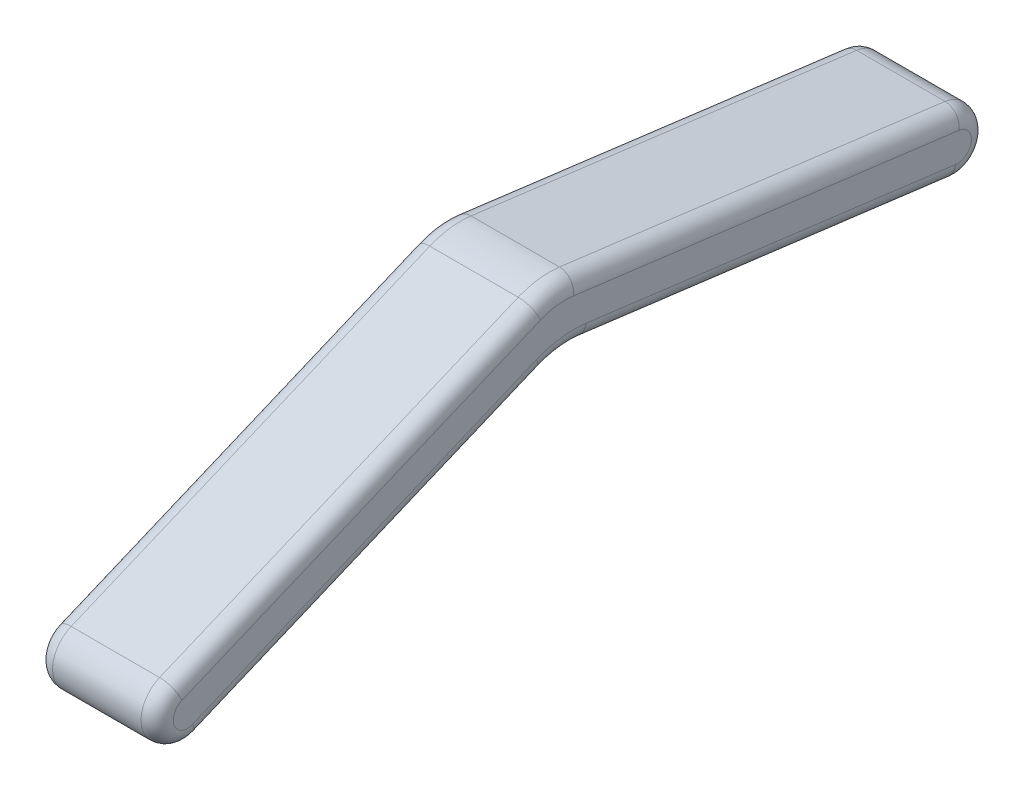
ISO-10303-21;
HEADER;
FILE_DESCRIPTION(('STEP AP214'),'2;1');
FILE_NAME('part.step','',(''),(''),'','','');
FILE_SCHEMA(('AUTOMOTIVE_DESIGN { 1 0 10303 214 1 1 1 1 }'));
ENDSEC;
DATA;
#1=APPLICATION_CONTEXT('core data for automotive mechanical design processes');
#2=APPLICATION_PROTOCOL_DEFINITION('international standard','automotive_design',2000,#1);
#3=PRODUCT_CONTEXT('',#1,'mechanical');
#4=PRODUCT('Part','Part','',(#3));
#5=PRODUCT_RELATED_PRODUCT_CATEGORY('part','',(#4));
#6=PRODUCT_DEFINITION_FORMATION('','',#4);
#7=PRODUCT_DEFINITION_CONTEXT('part definition',#1,'design');
#8=PRODUCT_DEFINITION('design','',#6,#7);
#9=PRODUCT_DEFINITION_SHAPE('','',#8);
#10=(LENGTH_UNIT() NAMED_UNIT(*) SI_UNIT(.MILLI.,.METRE.));
#11=(NAMED_UNIT(*) PLANE_ANGLE_UNIT() SI_UNIT($,.RADIAN.));
#12=(NAMED_UNIT(*) SI_UNIT($,.STERADIAN.) SOLID_ANGLE_UNIT());
#13=UNCERTAINTY_MEASURE_WITH_UNIT(LENGTH_MEASURE(1.E-05),#10,'distance_accuracy_value','');
#14=(GEOMETRIC_REPRESENTATION_CONTEXT(3) GLOBAL_UNCERTAINTY_ASSIGNED_CONTEXT((#13)) GLOBAL_UNIT_ASSIGNED_CONTEXT((#10,
#11,#12)) REPRESENTATION_CONTEXT('',''));
#15=CARTESIAN_POINT('',(0.,0.,0.));
#16=DIRECTION('',(0.,0.,1.));
#17=DIRECTION('',(1.,0.,0.));
#18=AXIS2_PLACEMENT_3D('',#15,#16,#17);
#19=CARTESIAN_POINT('',(7.5,5.18774565598026,-48.0342974570473));
#20=DIRECTION('',(-1.,0.,0.));
#21=DIRECTION('',(0.,0.,-1.));
#22=AXIS2_PLACEMENT_3D('',#19,#20,#21);
#23=CYLINDRICAL_SURFACE('',#22,9.99999999999999);
#24=DIRECTION('',(-1.,0.,0.));
#25=VECTOR('',#24,1.);
#26=CARTESIAN_POINT('',(7.5,14.4131959272416,-44.175402888329));
#27=LINE('',#26,#25);
#28=CARTESIAN_POINT('',(5.5,14.4131959272416,-44.175402888329));
#29=VERTEX_POINT('',#28);
#30=CARTESIAN_POINT('',(-5.5,14.4131959272416,-44.175402888329));
#31=VERTEX_POINT('',#30);
#32=EDGE_CURVE('E177',#29,#31,#27,.T.);
#33=ORIENTED_EDGE('',*,*,#32,.T.);
#34=CARTESIAN_POINT('',(-5.5,5.18774565598026,-48.0342974570473));
#35=DIRECTION('',(-1.,0.,0.));
#36=DIRECTION('',(0.,0.,1.));
#37=AXIS2_PLACEMENT_3D('',#34,#35,#36);
#38=CIRCLE('',#37,9.99999999999999);
#39=CARTESIAN_POINT('',(-5.5,15.1066672366018,-49.3051218656422));
#40=VERTEX_POINT('',#39);
#41=EDGE_CURVE('E236',#40,#31,#38,.F.);
#42=ORIENTED_EDGE('',*,*,#41,.F.);
#43=DIRECTION('',(-1.,0.,0.));
#44=VECTOR('',#43,1.);
#45=CARTESIAN_POINT('',(7.5,15.1066672366018,-49.3051218656422));
#46=LINE('',#45,#44);
#47=CARTESIAN_POINT('',(5.5,15.1066672366018,-49.3051218656422));
#48=VERTEX_POINT('',#47);
#49=EDGE_CURVE('E271',#48,#40,#46,.T.);
#50=ORIENTED_EDGE('',*,*,#49,.F.);
#51=CARTESIAN_POINT('',(5.5,5.18774565598026,-48.0342974570473));
#52=DIRECTION('',(-1.,0.,0.));
#53=DIRECTION('',(0.,0.,1.));
#54=AXIS2_PLACEMENT_3D('',#51,#52,#53);
#55=CIRCLE('',#54,9.99999999999999);
#56=EDGE_CURVE('E157',#29,#48,#55,.T.);
#57=ORIENTED_EDGE('',*,*,#56,.F.);
#58=EDGE_LOOP('',(#33,#42,#50,#57));
#59=FACE_BOUND('',#58,.T.);
#60=ADVANCED_FACE('F34',(#59),#23,.F.);
#61=CARTESIAN_POINT('',(7.5,-3.45954385172302,-1.44708546326935));
#62=DIRECTION('',(0.,0.922545027126137,0.385889456871828));
#63=DIRECTION('',(0.,0.385889456871828,-0.922545027126138));
#64=AXIS2_PLACEMENT_3D('',#61,#62,#63);
#65=PLANE('',#64);
#66=DIRECTION('',(-1.,0.,0.));
#67=VECTOR('',#66,1.);
#68=CARTESIAN_POINT('',(7.5,-3.45954385172302,-1.44708546326935));
#69=LINE('',#68,#67);
#70=CARTESIAN_POINT('',(5.5,-3.45954385172302,-1.44708546326935));
#71=VERTEX_POINT('',#70);
#72=CARTESIAN_POINT('',(-5.5,-3.45954385172302,-1.44708546326935));
#73=VERTEX_POINT('',#72);
#74=EDGE_CURVE('E182',#71,#73,#69,.T.);
#75=ORIENTED_EDGE('',*,*,#74,.T.);
#76=DIRECTION('',(0.,-0.385889456871828,0.922545027126138));
#77=VECTOR('',#76,1.);
#78=CARTESIAN_POINT('',(-5.5,-3.45954385172302,-1.44708546326935));
#79=LINE('',#78,#77);
#80=EDGE_CURVE('E231',#31,#73,#79,.T.);
#81=ORIENTED_EDGE('',*,*,#80,.F.);
#82=ORIENTED_EDGE('',*,*,#32,.F.);
#83=DIRECTION('',(0.,-0.385889456871828,0.922545027126138));
#84=VECTOR('',#83,1.);
#85=CARTESIAN_POINT('',(5.5,14.4131959272416,-44.175402888329));
#86=LINE('',#85,#84);
#87=EDGE_CURVE('E233',#71,#29,#86,.F.);
#88=ORIENTED_EDGE('',*,*,#87,.F.);
#89=EDGE_LOOP('',(#75,#81,#82,#88));
#90=FACE_BOUND('',#89,.T.);
#91=ADVANCED_FACE('F324',(#90),#65,.F.);
#92=CARTESIAN_POINT('',(7.5,0.,0.));
#93=DIRECTION('',(-1.,0.,0.));
#94=DIRECTION('',(0.,0.,-1.));
#95=AXIS2_PLACEMENT_3D('',#92,#93,#94);
#96=CYLINDRICAL_SURFACE('',#95,3.75);
#97=DIRECTION('',(-1.,0.,0.));
#98=VECTOR('',#97,1.);
#99=CARTESIAN_POINT('',(7.5,3.45954385172302,1.44708546326936));
#100=LINE('',#99,#98);
#101=CARTESIAN_POINT('',(5.5,3.45954385172302,1.44708546326936));
#102=VERTEX_POINT('',#101);
#103=CARTESIAN_POINT('',(-5.5,3.45954385172302,1.44708546326936));
#104=VERTEX_POINT('',#103);
#105=EDGE_CURVE('E312',#102,#104,#100,.T.);
#106=ORIENTED_EDGE('',*,*,#105,.T.);
#107=CARTESIAN_POINT('',(-5.5,0.,0.));
#108=DIRECTION('',(-1.,0.,0.));
#109=DIRECTION('',(0.,0.,1.));
#110=AXIS2_PLACEMENT_3D('',#107,#108,#109);
#111=CIRCLE('',#110,3.75);
#112=EDGE_CURVE('E226',#73,#104,#111,.T.);
#113=ORIENTED_EDGE('',*,*,#112,.F.);
#114=ORIENTED_EDGE('',*,*,#74,.F.);
#115=CARTESIAN_POINT('',(5.5,0.,0.));
#116=DIRECTION('',(-1.,0.,0.));
#117=DIRECTION('',(0.,0.,1.));
#118=AXIS2_PLACEMENT_3D('',#115,#116,#117);
#119=CIRCLE('',#118,3.75);
#120=EDGE_CURVE('E228',#102,#71,#119,.F.);
#121=ORIENTED_EDGE('',*,*,#120,.F.);
#122=EDGE_LOOP('',(#106,#113,#114,#121));
#123=FACE_BOUND('',#122,.T.);
#124=ADVANCED_FACE('F329',(#123),#96,.T.);
#125=CARTESIAN_POINT('',(7.5,3.45954385172302,1.44708546326935));
#126=DIRECTION('',(0.,-0.922545027126137,-0.385889456871828));
#127=DIRECTION('',(0.,-0.385889456871828,0.922545027126138));
#128=AXIS2_PLACEMENT_3D('',#125,#126,#127);
#129=PLANE('',#128);
#130=DIRECTION('',(-1.,0.,0.));
#131=VECTOR('',#130,1.);
#132=CARTESIAN_POINT('',(7.5,22.1077743932113,-43.1351959242888));
#133=LINE('',#132,#131);
#134=CARTESIAN_POINT('',(5.5,22.1077743932113,-43.1351959242888));
#135=VERTEX_POINT('',#134);
#136=CARTESIAN_POINT('',(-5.5,22.1077743932113,-43.1351959242888));
#137=VERTEX_POINT('',#136);
#138=EDGE_CURVE('E308',#135,#137,#133,.T.);
#139=ORIENTED_EDGE('',*,*,#138,.T.);
#140=DIRECTION('',(0.,0.385889456871828,-0.922545027126138));
#141=VECTOR('',#140,1.);
#142=CARTESIAN_POINT('',(-5.5,3.45954385172302,1.44708546326935));
#143=LINE('',#142,#141);
#144=EDGE_CURVE('E220',#104,#137,#143,.T.);
#145=ORIENTED_EDGE('',*,*,#144,.F.);
#146=ORIENTED_EDGE('',*,*,#105,.F.);
#147=DIRECTION('',(0.,0.385889456871828,-0.922545027126138));
#148=VECTOR('',#147,1.);
#149=CARTESIAN_POINT('',(5.5,3.45954385172301,1.44708546326937));
#150=LINE('',#149,#148);
#151=EDGE_CURVE('E223',#135,#102,#150,.F.);
#152=ORIENTED_EDGE('',*,*,#151,.F.);
#153=EDGE_LOOP('',(#139,#145,#146,#152));
#154=FACE_BOUND('',#153,.T.);
#155=ADVANCED_FACE('F404',(#154),#129,.F.);
#156=CARTESIAN_POINT('',(7.5,12.88232412195,-46.9940904930071));
#157=DIRECTION('',(-1.,0.,0.));
#158=DIRECTION('',(0.,0.,-1.));
#159=AXIS2_PLACEMENT_3D('',#156,#157,#158);
#160=CYLINDRICAL_SURFACE('',#159,10.);
#161=DIRECTION('',(-1.,0.,0.));
#162=VECTOR('',#161,1.);
#163=CARTESIAN_POINT('',(7.5,22.8012457025715,-48.264914901602));
#164=LINE('',#163,#162);
#165=CARTESIAN_POINT('',(5.5,22.8012457025715,-48.264914901602));
#166=VERTEX_POINT('',#165);
#167=CARTESIAN_POINT('',(-5.5,22.8012457025715,-48.264914901602));
#168=VERTEX_POINT('',#167);
#169=EDGE_CURVE('E304',#166,#168,#164,.T.);
#170=ORIENTED_EDGE('',*,*,#169,.T.);
#171=CARTESIAN_POINT('',(-5.5,12.88232412195,-46.9940904930071));
#172=DIRECTION('',(-1.,0.,0.));
#173=DIRECTION('',(0.,0.,1.));
#174=AXIS2_PLACEMENT_3D('',#171,#172,#173);
#175=CIRCLE('',#174,10.);
#176=EDGE_CURVE('E214',#137,#168,#175,.T.);
#177=ORIENTED_EDGE('',*,*,#176,.F.);
#178=ORIENTED_EDGE('',*,*,#138,.F.);
#179=CARTESIAN_POINT('',(5.5,12.88232412195,-46.9940904930071));
#180=DIRECTION('',(-1.,0.,0.));
#181=DIRECTION('',(0.,0.,1.));
#182=AXIS2_PLACEMENT_3D('',#179,#180,#181);
#183=CIRCLE('',#182,10.);
#184=EDGE_CURVE('E217',#166,#135,#183,.F.);
#185=ORIENTED_EDGE('',*,*,#184,.F.);
#186=EDGE_LOOP('',(#170,#177,#178,#185));
#187=FACE_BOUND('',#186,.T.);
#188=ADVANCED_FACE('F305',(#187),#160,.T.);
#189=CARTESIAN_POINT('',(7.5,22.8012457025715,-48.264914901602));
#190=DIRECTION('',(0.,-0.991892158062153,0.127082440859488));
#191=DIRECTION('',(0.,0.127082440859488,0.991892158062153));
#192=AXIS2_PLACEMENT_3D('',#189,#190,#191);
#193=PLANE('',#192);
#194=DIRECTION('',(-1.,0.,0.));
#195=VECTOR('',#194,1.);
#196=CARTESIAN_POINT('',(7.5,16.6599463933501,-96.1984184126376));
#197=LINE('',#196,#195);
#198=CARTESIAN_POINT('',(5.5,16.6599463933501,-96.1984184126376));
#199=VERTEX_POINT('',#198);
#200=CARTESIAN_POINT('',(-5.5,16.6599463933501,-96.1984184126376));
#201=VERTEX_POINT('',#200);
#202=EDGE_CURVE('E309',#199,#201,#197,.T.);
#203=ORIENTED_EDGE('',*,*,#202,.T.);
#204=DIRECTION('',(0.,-0.127082440859488,-0.991892158062153));
#205=VECTOR('',#204,1.);
#206=CARTESIAN_POINT('',(-5.5,22.8012457025715,-48.264914901602));
#207=LINE('',#206,#205);
#208=EDGE_CURVE('E208',#168,#201,#207,.T.);
#209=ORIENTED_EDGE('',*,*,#208,.F.);
#210=ORIENTED_EDGE('',*,*,#169,.F.);
#211=DIRECTION('',(0.,-0.127082440859488,-0.991892158062153));
#212=VECTOR('',#211,1.);
#213=CARTESIAN_POINT('',(5.5,22.8012457025715,-48.264914901602));
#214=LINE('',#213,#212);
#215=EDGE_CURVE('E211',#199,#166,#214,.F.);
#216=ORIENTED_EDGE('',*,*,#215,.F.);
#217=EDGE_LOOP('',(#203,#209,#210,#216));
#218=FACE_BOUND('',#217,.T.);
#219=ADVANCED_FACE('F484',(#218),#193,.F.);
#220=CARTESIAN_POINT('',(7.5,12.940350800617,-95.7218592594145));
#221=DIRECTION('',(-1.,0.,0.));
#222=DIRECTION('',(0.,0.,-1.));
#223=AXIS2_PLACEMENT_3D('',#220,#221,#222);
#224=CYLINDRICAL_SURFACE('',#223,3.75);
#225=DIRECTION('',(-1.,0.,0.));
#226=VECTOR('',#225,1.);
#227=CARTESIAN_POINT('',(7.5,9.22075520788394,-95.2453001061914));
#228=LINE('',#227,#226);
#229=CARTESIAN_POINT('',(5.5,9.22075520788394,-95.2453001061914));
#230=VERTEX_POINT('',#229);
#231=CARTESIAN_POINT('',(-5.5,9.22075520788394,-95.2453001061914));
#232=VERTEX_POINT('',#231);
#233=EDGE_CURVE('E314',#230,#232,#228,.T.);
#234=ORIENTED_EDGE('',*,*,#233,.T.);
#235=CARTESIAN_POINT('',(-5.5,12.940350800617,-95.7218592594145));
#236=DIRECTION('',(-1.,0.,0.));
#237=DIRECTION('',(0.,0.,1.));
#238=AXIS2_PLACEMENT_3D('',#235,#236,#237);
#239=CIRCLE('',#238,3.75);
#240=EDGE_CURVE('E202',#201,#232,#239,.T.);
#241=ORIENTED_EDGE('',*,*,#240,.F.);
#242=ORIENTED_EDGE('',*,*,#202,.F.);
#243=CARTESIAN_POINT('',(5.5,12.940350800617,-95.7218592594145));
#244=DIRECTION('',(-1.,0.,0.));
#245=DIRECTION('',(0.,0.,1.));
#246=AXIS2_PLACEMENT_3D('',#243,#244,#245);
#247=CIRCLE('',#246,3.75);
#248=EDGE_CURVE('E205',#230,#199,#247,.F.);
#249=ORIENTED_EDGE('',*,*,#248,.F.);
#250=EDGE_LOOP('',(#234,#241,#242,#249));
#251=FACE_BOUND('',#250,.T.);
#252=ADVANCED_FACE('F345',(#251),#224,.T.);
#253=CARTESIAN_POINT('',(7.5,15.1066672366018,-49.3051218656422));
#254=DIRECTION('',(0.,0.991892158062153,-0.127082440859488));
#255=DIRECTION('',(0.,-0.127082440859488,-0.991892158062153));
#256=AXIS2_PLACEMENT_3D('',#253,#254,#255);
#257=PLANE('',#256);
#258=ORIENTED_EDGE('',*,*,#49,.T.);
#259=DIRECTION('',(0.,0.127082440859488,0.991892158062153));
#260=VECTOR('',#259,1.);
#261=CARTESIAN_POINT('',(-5.5,15.1066672366018,-49.3051218656422));
#262=LINE('',#261,#260);
#263=EDGE_CURVE('E170',#232,#40,#262,.T.);
#264=ORIENTED_EDGE('',*,*,#263,.F.);
#265=ORIENTED_EDGE('',*,*,#233,.F.);
#266=DIRECTION('',(0.,0.127082440859488,0.991892158062153));
#267=VECTOR('',#266,1.);
#268=CARTESIAN_POINT('',(5.5,9.22075520788394,-95.2453001061915));
#269=LINE('',#268,#267);
#270=EDGE_CURVE('E200',#48,#230,#269,.F.);
#271=ORIENTED_EDGE('',*,*,#270,.F.);
#272=EDGE_LOOP('',(#258,#264,#265,#271));
#273=FACE_BOUND('',#272,.T.);
#274=ADVANCED_FACE('F347',(#273),#257,.F.);
#275=CARTESIAN_POINT('',(7.5,5.18774565598026,-48.0342974570473));
#276=DIRECTION('',(1.,0.,0.));
#277=DIRECTION('',(0.,0.,1.));
#278=AXIS2_PLACEMENT_3D('',#275,#276,#277);
#279=PLANE('',#278);
#280=CARTESIAN_POINT('',(7.5,12.940350800617,-95.7218592594145));
#281=DIRECTION('',(-1.,0.,0.));
#282=DIRECTION('',(0.,0.,1.));
#283=AXIS2_PLACEMENT_3D('',#280,#281,#282);
#284=CIRCLE('',#283,1.75);
#285=CARTESIAN_POINT('',(7.5,14.6761620772258,-95.9442535309186));
#286=VERTEX_POINT('',#285);
#287=CARTESIAN_POINT('',(7.5,11.2045395240082,-95.4994649879104));
#288=VERTEX_POINT('',#287);
#289=EDGE_CURVE('E171',#286,#288,#284,.T.);
#290=ORIENTED_EDGE('',*,*,#289,.F.);
#291=DIRECTION('',(0.,-0.127082440859488,-0.991892158062153));
#292=VECTOR('',#291,1.);
#293=CARTESIAN_POINT('',(7.5,14.6761620772258,-95.9442535309186));
#294=LINE('',#293,#292);
#295=CARTESIAN_POINT('',(7.5,20.8174613864472,-48.010750019883));
#296=VERTEX_POINT('',#295);
#297=EDGE_CURVE('E194',#296,#286,#294,.T.);
#298=ORIENTED_EDGE('',*,*,#297,.F.);
#299=CARTESIAN_POINT('',(7.5,12.88232412195,-46.9940904930071));
#300=DIRECTION('',(-1.,0.,0.));
#301=DIRECTION('',(0.,0.,1.));
#302=AXIS2_PLACEMENT_3D('',#299,#300,#301);
#303=CIRCLE('',#302,8.);
#304=CARTESIAN_POINT('',(7.5,20.2626843389591,-43.9069748380324));
#305=VERTEX_POINT('',#304);
#306=EDGE_CURVE('E191',#305,#296,#303,.T.);
#307=ORIENTED_EDGE('',*,*,#306,.F.);
#308=DIRECTION('',(0.,0.385889456871828,-0.922545027126138));
#309=VECTOR('',#308,1.);
#310=CARTESIAN_POINT('',(7.5,20.2626843389591,-43.9069748380324));
#311=LINE('',#310,#309);
#312=CARTESIAN_POINT('',(7.5,1.61445379747074,0.675306549525699));
#313=VERTEX_POINT('',#312);
#314=EDGE_CURVE('E188',#313,#305,#311,.T.);
#315=ORIENTED_EDGE('',*,*,#314,.F.);
#316=CARTESIAN_POINT('',(7.5,0.,0.));
#317=DIRECTION('',(-1.,0.,0.));
#318=DIRECTION('',(0.,0.,1.));
#319=AXIS2_PLACEMENT_3D('',#316,#317,#318);
#320=CIRCLE('',#319,1.75);
#321=CARTESIAN_POINT('',(7.5,-1.61445379747074,-0.675306549525699));
#322=VERTEX_POINT('',#321);
#323=EDGE_CURVE('E179',#322,#313,#320,.T.);
#324=ORIENTED_EDGE('',*,*,#323,.F.);
#325=DIRECTION('',(0.,-0.385889456871828,0.922545027126138));
#326=VECTOR('',#325,1.);
#327=CARTESIAN_POINT('',(7.5,-1.61445379747075,-0.675306549525682));
#328=LINE('',#327,#326);
#329=CARTESIAN_POINT('',(7.5,16.2582859814939,-43.4036239745853));
#330=VERTEX_POINT('',#329);
#331=EDGE_CURVE('E176',#330,#322,#328,.T.);
#332=ORIENTED_EDGE('',*,*,#331,.F.);
#333=CARTESIAN_POINT('',(7.5,5.18774565598026,-48.0342974570473));
#334=DIRECTION('',(-1.,0.,0.));
#335=DIRECTION('',(0.,0.,1.));
#336=AXIS2_PLACEMENT_3D('',#333,#334,#335);
#337=CIRCLE('',#336,12.);
#338=CARTESIAN_POINT('',(7.5,17.0904515527261,-49.5592867473612));
#339=VERTEX_POINT('',#338);
#340=EDGE_CURVE('E154',#339,#330,#337,.F.);
#341=ORIENTED_EDGE('',*,*,#340,.F.);
#342=DIRECTION('',(0.,0.127082440859488,0.991892158062153));
#343=VECTOR('',#342,1.);
#344=CARTESIAN_POINT('',(7.5,17.0904515527261,-49.5592867473612));
#345=LINE('',#344,#343);
#346=EDGE_CURVE('E165',#288,#339,#345,.T.);
#347=ORIENTED_EDGE('',*,*,#346,.F.);
#348=EDGE_LOOP('',(#290,#298,#307,#315,#324,#332,#341,#347));
#349=FACE_BOUND('',#348,.T.);
#350=ADVANCED_FACE('F173',(#349),#279,.T.);
#351=CARTESIAN_POINT('',(-7.5,5.18774565598026,-48.0342974570473));
#352=DIRECTION('',(1.,0.,0.));
#353=DIRECTION('',(0.,0.,1.));
#354=AXIS2_PLACEMENT_3D('',#351,#352,#353);
#355=PLANE('',#354);
#356=CARTESIAN_POINT('',(-7.5,0.,0.));
#357=DIRECTION('',(-1.,0.,0.));
#358=DIRECTION('',(0.,0.,1.));
#359=AXIS2_PLACEMENT_3D('',#356,#357,#358);
#360=CIRCLE('',#359,1.75);
#361=CARTESIAN_POINT('',(-7.5,1.61445379747074,0.675306549525699));
#362=VERTEX_POINT('',#361);
#363=CARTESIAN_POINT('',(-7.5,-1.61445379747074,-0.675306549525699));
#364=VERTEX_POINT('',#363);
#365=EDGE_CURVE('E43',#362,#364,#360,.F.);
#366=ORIENTED_EDGE('',*,*,#365,.F.);
#367=DIRECTION('',(0.,0.385889456871828,-0.922545027126138));
#368=VECTOR('',#367,1.);
#369=CARTESIAN_POINT('',(-7.5,19.4871935764354,-42.053010875534));
#370=LINE('',#369,#368);
#371=CARTESIAN_POINT('',(-7.5,20.2626843389591,-43.9069748380324));
#372=VERTEX_POINT('',#371);
#373=EDGE_CURVE('E255',#372,#362,#370,.F.);
#374=ORIENTED_EDGE('',*,*,#373,.F.);
#375=CARTESIAN_POINT('',(-7.5,12.88232412195,-46.9940904930071));
#376=DIRECTION('',(-1.,0.,0.));
#377=DIRECTION('',(0.,0.,1.));
#378=AXIS2_PLACEMENT_3D('',#375,#376,#377);
#379=CIRCLE('',#378,8.);
#380=CARTESIAN_POINT('',(-7.5,20.8174613864472,-48.010750019883));
#381=VERTEX_POINT('',#380);
#382=EDGE_CURVE('E252',#381,#372,#379,.F.);
#383=ORIENTED_EDGE('',*,*,#382,.F.);
#384=DIRECTION('',(0.,-0.127082440859488,-0.991892158062153));
#385=VECTOR('',#384,1.);
#386=CARTESIAN_POINT('',(-7.5,20.5620741059436,-50.0040752903694));
#387=LINE('',#386,#385);
#388=CARTESIAN_POINT('',(-7.5,14.6761620772258,-95.9442535309186));
#389=VERTEX_POINT('',#388);
#390=EDGE_CURVE('E249',#389,#381,#387,.F.);
#391=ORIENTED_EDGE('',*,*,#390,.F.);
#392=CARTESIAN_POINT('',(-7.5,12.940350800617,-95.7218592594145));
#393=DIRECTION('',(-1.,0.,0.));
#394=DIRECTION('',(0.,0.,1.));
#395=AXIS2_PLACEMENT_3D('',#392,#393,#394);
#396=CIRCLE('',#395,1.75);
#397=CARTESIAN_POINT('',(-7.5,11.2045395240082,-95.4994649879104));
#398=VERTEX_POINT('',#397);
#399=EDGE_CURVE('E246',#398,#389,#396,.F.);
#400=ORIENTED_EDGE('',*,*,#399,.F.);
#401=DIRECTION('',(0.,0.127082440859488,0.991892158062153));
#402=VECTOR('',#401,1.);
#403=CARTESIAN_POINT('',(-7.5,17.0904515527261,-49.5592867473612));
#404=LINE('',#403,#402);
#405=CARTESIAN_POINT('',(-7.5,17.0904515527261,-49.5592867473612));
#406=VERTEX_POINT('',#405);
#407=EDGE_CURVE('E243',#406,#398,#404,.F.);
#408=ORIENTED_EDGE('',*,*,#407,.F.);
#409=CARTESIAN_POINT('',(-7.5,5.18774565598026,-48.0342974570473));
#410=DIRECTION('',(-1.,0.,0.));
#411=DIRECTION('',(0.,0.,1.));
#412=AXIS2_PLACEMENT_3D('',#409,#410,#411);
#413=CIRCLE('',#412,12.);
#414=CARTESIAN_POINT('',(-7.5,16.2582859814939,-43.4036239745853));
#415=VERTEX_POINT('',#414);
#416=EDGE_CURVE('E240',#415,#406,#413,.T.);
#417=ORIENTED_EDGE('',*,*,#416,.F.);
#418=DIRECTION('',(0.,-0.385889456871828,0.922545027126138));
#419=VECTOR('',#418,1.);
#420=CARTESIAN_POINT('',(-7.5,16.2582859814939,-43.4036239745854));
#421=LINE('',#420,#419);
#422=EDGE_CURVE('E11',#364,#415,#421,.F.);
#423=ORIENTED_EDGE('',*,*,#422,.F.);
#424=EDGE_LOOP('',(#366,#374,#383,#391,#400,#408,#417,#423));
#425=FACE_BOUND('',#424,.T.);
#426=ADVANCED_FACE('F294',(#425),#355,.F.);
#427=CARTESIAN_POINT('',(5.5,19.4871935764354,-42.053010875534));
#428=DIRECTION('',(0.,-0.385889456871828,0.922545027126138));
#429=DIRECTION('',(0.,0.922545027126137,0.385889456871828));
#430=AXIS2_PLACEMENT_3D('',#427,#428,#429);
#431=CYLINDRICAL_SURFACE('',#430,2.);
#432=CARTESIAN_POINT('',(5.5,1.61445379747074,0.675306549525699));
#433=DIRECTION('',(0.,0.385889456871828,-0.922545027126137));
#434=DIRECTION('',(0.,0.922545027126138,0.385889456871828));
#435=AXIS2_PLACEMENT_3D('',#432,#433,#434);
#436=CIRCLE('',#435,2.);
#437=EDGE_CURVE('E267',#102,#313,#436,.T.);
#438=ORIENTED_EDGE('',*,*,#437,.T.);
#439=ORIENTED_EDGE('',*,*,#314,.T.);
#440=CARTESIAN_POINT('',(5.5,20.2626843389591,-43.9069748380324));
#441=DIRECTION('',(0.,-0.385889456871831,0.922545027126136));
#442=DIRECTION('',(0.,-0.922545027126136,-0.385889456871831));
#443=AXIS2_PLACEMENT_3D('',#440,#441,#442);
#444=CIRCLE('',#443,2.);
#445=EDGE_CURVE('E269',#305,#135,#444,.T.);
#446=ORIENTED_EDGE('',*,*,#445,.T.);
#447=ORIENTED_EDGE('',*,*,#151,.T.);
#448=EDGE_LOOP('',(#438,#439,#446,#447));
#449=FACE_BOUND('',#448,.T.);
#450=ADVANCED_FACE('F391',(#449),#431,.T.);
#451=CARTESIAN_POINT('',(5.5,12.88232412195,-46.9940904930071));
#452=DIRECTION('',(1.,0.,0.));
#453=DIRECTION('',(0.,0.,1.));
#454=AXIS2_PLACEMENT_3D('',#451,#452,#453);
#455=TOROIDAL_SURFACE('',#454,8.,2.);
#456=ORIENTED_EDGE('',*,*,#445,.F.);
#457=ORIENTED_EDGE('',*,*,#306,.T.);
#458=CARTESIAN_POINT('',(5.5,20.8174613864472,-48.010750019883));
#459=DIRECTION('',(0.,0.127082440859488,0.991892158062153));
#460=DIRECTION('',(0.,-0.991892158062153,0.127082440859488));
#461=AXIS2_PLACEMENT_3D('',#458,#459,#460);
#462=CIRCLE('',#461,2.);
#463=EDGE_CURVE('E265',#296,#166,#462,.T.);
#464=ORIENTED_EDGE('',*,*,#463,.T.);
#465=ORIENTED_EDGE('',*,*,#184,.T.);
#466=EDGE_LOOP('',(#456,#457,#464,#465));
#467=FACE_BOUND('',#466,.T.);
#468=ADVANCED_FACE('F387',(#467),#455,.T.);
#469=CARTESIAN_POINT('',(5.5,0.,0.));
#470=DIRECTION('',(1.,0.,0.));
#471=DIRECTION('',(0.,0.,1.));
#472=AXIS2_PLACEMENT_3D('',#469,#470,#471);
#473=DEGENERATE_TOROIDAL_SURFACE('',#472,1.75,2.,.T.);
#474=ORIENTED_EDGE('',*,*,#437,.F.);
#475=ORIENTED_EDGE('',*,*,#120,.T.);
#476=CARTESIAN_POINT('',(5.5,-1.61445379747074,-0.675306549525699));
#477=DIRECTION('',(0.,-0.385889456871828,0.922545027126137));
#478=DIRECTION('',(0.,-0.922545027126138,-0.385889456871828));
#479=AXIS2_PLACEMENT_3D('',#476,#477,#478);
#480=CIRCLE('',#479,2.);
#481=EDGE_CURVE('E263',#71,#322,#480,.T.);
#482=ORIENTED_EDGE('',*,*,#481,.T.);
#483=ORIENTED_EDGE('',*,*,#323,.T.);
#484=EDGE_LOOP('',(#474,#475,#482,#483));
#485=FACE_BOUND('',#484,.T.);
#486=ADVANCED_FACE('F383',(#485),#473,.T.);
#487=CARTESIAN_POINT('',(5.5,20.5620741059436,-50.0040752903694));
#488=DIRECTION('',(0.,0.127082440859488,0.991892158062153));
#489=DIRECTION('',(0.,0.991892158062153,-0.127082440859488));
#490=AXIS2_PLACEMENT_3D('',#487,#488,#489);
#491=CYLINDRICAL_SURFACE('',#490,2.);
#492=ORIENTED_EDGE('',*,*,#463,.F.);
#493=ORIENTED_EDGE('',*,*,#297,.T.);
#494=CARTESIAN_POINT('',(5.5,14.6761620772258,-95.9442535309186));
#495=DIRECTION('',(0.,0.127082440859488,0.991892158062153));
#496=DIRECTION('',(0.,-0.991892158062153,0.127082440859488));
#497=AXIS2_PLACEMENT_3D('',#494,#495,#496);
#498=CIRCLE('',#497,2.);
#499=EDGE_CURVE('E261',#286,#199,#498,.T.);
#500=ORIENTED_EDGE('',*,*,#499,.T.);
#501=ORIENTED_EDGE('',*,*,#215,.T.);
#502=EDGE_LOOP('',(#492,#493,#500,#501));
#503=FACE_BOUND('',#502,.T.);
#504=ADVANCED_FACE('F379',(#503),#491,.T.);
#505=CARTESIAN_POINT('',(5.5,16.2582859814939,-43.4036239745854));
#506=DIRECTION('',(0.,0.385889456871828,-0.922545027126138));
#507=DIRECTION('',(0.,-0.922545027126137,-0.385889456871828));
#508=AXIS2_PLACEMENT_3D('',#505,#506,#507);
#509=CYLINDRICAL_SURFACE('',#508,2.);
#510=ORIENTED_EDGE('',*,*,#481,.F.);
#511=ORIENTED_EDGE('',*,*,#87,.T.);
#512=CARTESIAN_POINT('',(5.5,16.2582859814939,-43.4036239745853));
#513=DIRECTION('',(0.,-0.385889456871829,0.922545027126137));
#514=DIRECTION('',(0.,-0.922545027126137,-0.385889456871829));
#515=AXIS2_PLACEMENT_3D('',#512,#513,#514);
#516=CIRCLE('',#515,2.);
#517=EDGE_CURVE('E259',#29,#330,#516,.T.);
#518=ORIENTED_EDGE('',*,*,#517,.T.);
#519=ORIENTED_EDGE('',*,*,#331,.T.);
#520=EDGE_LOOP('',(#510,#511,#518,#519));
#521=FACE_BOUND('',#520,.T.);
#522=ADVANCED_FACE('F375',(#521),#509,.T.);
#523=CARTESIAN_POINT('',(5.5,12.940350800617,-95.7218592594145));
#524=DIRECTION('',(1.,0.,0.));
#525=DIRECTION('',(0.,0.,1.));
#526=AXIS2_PLACEMENT_3D('',#523,#524,#525);
#527=DEGENERATE_TOROIDAL_SURFACE('',#526,1.75,2.,.T.);
#528=ORIENTED_EDGE('',*,*,#499,.F.);
#529=ORIENTED_EDGE('',*,*,#289,.T.);
#530=CARTESIAN_POINT('',(5.5,11.2045395240082,-95.4994649879104));
#531=DIRECTION('',(0.,-0.127082440859488,-0.991892158062153));
#532=DIRECTION('',(0.,0.991892158062153,-0.127082440859488));
#533=AXIS2_PLACEMENT_3D('',#530,#531,#532);
#534=CIRCLE('',#533,2.);
#535=EDGE_CURVE('E162',#288,#230,#534,.T.);
#536=ORIENTED_EDGE('',*,*,#535,.T.);
#537=ORIENTED_EDGE('',*,*,#248,.T.);
#538=EDGE_LOOP('',(#528,#529,#536,#537));
#539=FACE_BOUND('',#538,.T.);
#540=ADVANCED_FACE('F372',(#539),#527,.T.);
#541=CARTESIAN_POINT('',(5.5,5.18774565598026,-48.0342974570473));
#542=DIRECTION('',(1.,0.,0.));
#543=DIRECTION('',(0.,0.,1.));
#544=AXIS2_PLACEMENT_3D('',#541,#542,#543);
#545=TOROIDAL_SURFACE('',#544,12.,2.);
#546=ORIENTED_EDGE('',*,*,#517,.F.);
#547=ORIENTED_EDGE('',*,*,#56,.T.);
#548=CARTESIAN_POINT('',(5.5,17.0904515527261,-49.5592867473612));
#549=DIRECTION('',(0.,0.127082440859492,0.991892158062152));
#550=DIRECTION('',(0.,-0.991892158062152,0.127082440859492));
#551=AXIS2_PLACEMENT_3D('',#548,#549,#550);
#552=CIRCLE('',#551,2.);
#553=EDGE_CURVE('E150',#48,#339,#552,.T.);
#554=ORIENTED_EDGE('',*,*,#553,.T.);
#555=ORIENTED_EDGE('',*,*,#340,.T.);
#556=EDGE_LOOP('',(#546,#547,#554,#555));
#557=FACE_BOUND('',#556,.T.);
#558=ADVANCED_FACE('F152',(#557),#545,.T.);
#559=CARTESIAN_POINT('',(5.5,17.0904515527261,-49.5592867473612));
#560=DIRECTION('',(0.,-0.127082440859488,-0.991892158062153));
#561=DIRECTION('',(0.,-0.991892158062153,0.127082440859488));
#562=AXIS2_PLACEMENT_3D('',#559,#560,#561);
#563=CYLINDRICAL_SURFACE('',#562,2.);
#564=ORIENTED_EDGE('',*,*,#535,.F.);
#565=ORIENTED_EDGE('',*,*,#346,.T.);
#566=ORIENTED_EDGE('',*,*,#553,.F.);
#567=ORIENTED_EDGE('',*,*,#270,.T.);
#568=EDGE_LOOP('',(#564,#565,#566,#567));
#569=FACE_BOUND('',#568,.T.);
#570=ADVANCED_FACE('F166',(#569),#563,.T.);
#571=CARTESIAN_POINT('',(-5.5,20.8174613864472,-48.010750019883));
#572=DIRECTION('',(0.,-0.127082440859488,-0.991892158062153));
#573=DIRECTION('',(0.,-0.991892158062153,0.127082440859488));
#574=AXIS2_PLACEMENT_3D('',#571,#572,#573);
#575=CYLINDRICAL_SURFACE('',#574,2.);
#576=CARTESIAN_POINT('',(-5.5,20.8174613864472,-48.010750019883));
#577=DIRECTION('',(0.,-0.127082440859492,-0.991892158062152));
#578=DIRECTION('',(0.,0.991892158062152,-0.127082440859492));
#579=AXIS2_PLACEMENT_3D('',#576,#577,#578);
#580=CIRCLE('',#579,2.);
#581=EDGE_CURVE('E281',#381,#168,#580,.T.);
#582=ORIENTED_EDGE('',*,*,#581,.T.);
#583=ORIENTED_EDGE('',*,*,#208,.T.);
#584=CARTESIAN_POINT('',(-5.5,14.6761620772258,-95.9442535309186));
#585=DIRECTION('',(0.,0.127082440859488,0.991892158062153));
#586=DIRECTION('',(0.,-0.991892158062153,0.127082440859488));
#587=AXIS2_PLACEMENT_3D('',#584,#585,#586);
#588=CIRCLE('',#587,2.);
#589=EDGE_CURVE('E38',#201,#389,#588,.T.);
#590=ORIENTED_EDGE('',*,*,#589,.T.);
#591=ORIENTED_EDGE('',*,*,#390,.T.);
#592=EDGE_LOOP('',(#582,#583,#590,#591));
#593=FACE_BOUND('',#592,.T.);
#594=ADVANCED_FACE('F36',(#593),#575,.T.);
#595=CARTESIAN_POINT('',(-5.5,12.940350800617,-95.7218592594145));
#596=DIRECTION('',(1.,0.,0.));
#597=DIRECTION('',(0.,0.,1.));
#598=AXIS2_PLACEMENT_3D('',#595,#596,#597);
#599=DEGENERATE_TOROIDAL_SURFACE('',#598,1.75,2.,.T.);
#600=ORIENTED_EDGE('',*,*,#589,.F.);
#601=ORIENTED_EDGE('',*,*,#240,.T.);
#602=CARTESIAN_POINT('',(-5.5,11.2045395240082,-95.4994649879104));
#603=DIRECTION('',(0.,-0.127082440859488,-0.991892158062153));
#604=DIRECTION('',(0.,0.991892158062153,-0.127082440859488));
#605=AXIS2_PLACEMENT_3D('',#602,#603,#604);
#606=CIRCLE('',#605,2.);
#607=EDGE_CURVE('E280',#232,#398,#606,.T.);
#608=ORIENTED_EDGE('',*,*,#607,.T.);
#609=ORIENTED_EDGE('',*,*,#399,.T.);
#610=EDGE_LOOP('',(#600,#601,#608,#609));
#611=FACE_BOUND('',#610,.T.);
#612=ADVANCED_FACE('F290',(#611),#599,.T.);
#613=CARTESIAN_POINT('',(-5.5,12.88232412195,-46.9940904930071));
#614=DIRECTION('',(1.,0.,0.));
#615=DIRECTION('',(0.,0.,1.));
#616=AXIS2_PLACEMENT_3D('',#613,#614,#615);
#617=TOROIDAL_SURFACE('',#616,8.,2.);
#618=ORIENTED_EDGE('',*,*,#581,.F.);
#619=ORIENTED_EDGE('',*,*,#382,.T.);
#620=CARTESIAN_POINT('',(-5.5,20.2626843389591,-43.9069748380324));
#621=DIRECTION('',(0.,0.385889456871828,-0.922545027126137));
#622=DIRECTION('',(0.,0.922545027126137,0.385889456871829));
#623=AXIS2_PLACEMENT_3D('',#620,#621,#622);
#624=CIRCLE('',#623,2.);
#625=EDGE_CURVE('E278',#372,#137,#624,.T.);
#626=ORIENTED_EDGE('',*,*,#625,.T.);
#627=ORIENTED_EDGE('',*,*,#176,.T.);
#628=EDGE_LOOP('',(#618,#619,#626,#627));
#629=FACE_BOUND('',#628,.T.);
#630=ADVANCED_FACE('F297',(#629),#617,.T.);
#631=CARTESIAN_POINT('',(-5.5,17.0904515527261,-49.5592867473612));
#632=DIRECTION('',(0.,0.127082440859488,0.991892158062153));
#633=DIRECTION('',(0.,0.991892158062153,-0.127082440859488));
#634=AXIS2_PLACEMENT_3D('',#631,#632,#633);
#635=CYLINDRICAL_SURFACE('',#634,2.);
#636=ORIENTED_EDGE('',*,*,#607,.F.);
#637=ORIENTED_EDGE('',*,*,#263,.T.);
#638=CARTESIAN_POINT('',(-5.5,17.0904515527261,-49.5592867473612));
#639=DIRECTION('',(0.,-0.127082440859488,-0.991892158062153));
#640=DIRECTION('',(0.,0.991892158062153,-0.127082440859488));
#641=AXIS2_PLACEMENT_3D('',#638,#639,#640);
#642=CIRCLE('',#641,2.);
#643=EDGE_CURVE('E276',#40,#406,#642,.T.);
#644=ORIENTED_EDGE('',*,*,#643,.T.);
#645=ORIENTED_EDGE('',*,*,#407,.T.);
#646=EDGE_LOOP('',(#636,#637,#644,#645));
#647=FACE_BOUND('',#646,.T.);
#648=ADVANCED_FACE('F349',(#647),#635,.T.);
#649=CARTESIAN_POINT('',(-5.5,1.61445379747074,0.675306549525699));
#650=DIRECTION('',(0.,0.385889456871828,-0.922545027126138));
#651=DIRECTION('',(0.,-0.922545027126137,-0.385889456871828));
#652=AXIS2_PLACEMENT_3D('',#649,#650,#651);
#653=CYLINDRICAL_SURFACE('',#652,2.);
#654=ORIENTED_EDGE('',*,*,#625,.F.);
#655=ORIENTED_EDGE('',*,*,#373,.T.);
#656=CARTESIAN_POINT('',(-5.5,1.61445379747074,0.675306549525699));
#657=DIRECTION('',(0.,0.385889456871828,-0.922545027126137));
#658=DIRECTION('',(0.,0.922545027126138,0.385889456871828));
#659=AXIS2_PLACEMENT_3D('',#656,#657,#658);
#660=CIRCLE('',#659,2.);
#661=EDGE_CURVE('E58',#362,#104,#660,.T.);
#662=ORIENTED_EDGE('',*,*,#661,.T.);
#663=ORIENTED_EDGE('',*,*,#144,.T.);
#664=EDGE_LOOP('',(#654,#655,#662,#663));
#665=FACE_BOUND('',#664,.T.);
#666=ADVANCED_FACE('F358',(#665),#653,.T.);
#667=CARTESIAN_POINT('',(-5.5,5.18774565598026,-48.0342974570473));
#668=DIRECTION('',(1.,0.,0.));
#669=DIRECTION('',(0.,0.,1.));
#670=AXIS2_PLACEMENT_3D('',#667,#668,#669);
#671=TOROIDAL_SURFACE('',#670,12.,2.);
#672=ORIENTED_EDGE('',*,*,#643,.F.);
#673=ORIENTED_EDGE('',*,*,#41,.T.);
#674=CARTESIAN_POINT('',(-5.5,16.2582859814939,-43.4036239745853));
#675=DIRECTION('',(0.,0.385889456871832,-0.922545027126136));
#676=DIRECTION('',(0.,0.922545027126136,0.385889456871832));
#677=AXIS2_PLACEMENT_3D('',#674,#675,#676);
#678=CIRCLE('',#677,2.);
#679=EDGE_CURVE('E273',#31,#415,#678,.T.);
#680=ORIENTED_EDGE('',*,*,#679,.T.);
#681=ORIENTED_EDGE('',*,*,#416,.T.);
#682=EDGE_LOOP('',(#672,#673,#680,#681));
#683=FACE_BOUND('',#682,.T.);
#684=ADVANCED_FACE('F334',(#683),#671,.T.);
#685=CARTESIAN_POINT('',(-5.5,0.,0.));
#686=DIRECTION('',(1.,0.,0.));
#687=DIRECTION('',(0.,0.,1.));
#688=AXIS2_PLACEMENT_3D('',#685,#686,#687);
#689=DEGENERATE_TOROIDAL_SURFACE('',#688,1.75,2.,.T.);
#690=ORIENTED_EDGE('',*,*,#661,.F.);
#691=ORIENTED_EDGE('',*,*,#365,.T.);
#692=CARTESIAN_POINT('',(-5.5,-1.61445379747074,-0.675306549525699));
#693=DIRECTION('',(0.,-0.385889456871828,0.922545027126137));
#694=DIRECTION('',(0.,-0.922545027126138,-0.385889456871828));
#695=AXIS2_PLACEMENT_3D('',#692,#693,#694);
#696=CIRCLE('',#695,2.);
#697=EDGE_CURVE('E50',#364,#73,#696,.T.);
#698=ORIENTED_EDGE('',*,*,#697,.T.);
#699=ORIENTED_EDGE('',*,*,#112,.T.);
#700=EDGE_LOOP('',(#690,#691,#698,#699));
#701=FACE_BOUND('',#700,.T.);
#702=ADVANCED_FACE('F350',(#701),#689,.T.);
#703=CARTESIAN_POINT('',(-5.5,-1.61445379747074,-0.675306549525699));
#704=DIRECTION('',(0.,-0.385889456871828,0.922545027126138));
#705=DIRECTION('',(0.,0.922545027126137,0.385889456871828));
#706=AXIS2_PLACEMENT_3D('',#703,#704,#705);
#707=CYLINDRICAL_SURFACE('',#706,2.);
#708=ORIENTED_EDGE('',*,*,#679,.F.);
#709=ORIENTED_EDGE('',*,*,#80,.T.);
#710=ORIENTED_EDGE('',*,*,#697,.F.);
#711=ORIENTED_EDGE('',*,*,#422,.T.);
#712=EDGE_LOOP('',(#708,#709,#710,#711));
#713=FACE_BOUND('',#712,.T.);
#714=ADVANCED_FACE('F331',(#713),#707,.T.);
#715=CLOSED_SHELL('',(#60,#91,#124,#155,#188,#219,#252,#274,#350,#426,#450,#468,#486,#504,#522,
#540,#558,#570,#594,#612,#630,#648,#666,#684,#702,#714));
#716=MANIFOLD_SOLID_BREP('B2',#715);
#717=ADVANCED_BREP_SHAPE_REPRESENTATION('',(#18,#716),#14);
#718=SHAPE_DEFINITION_REPRESENTATION(#9,#717);
ENDSEC;
END-ISO-10303-21;
